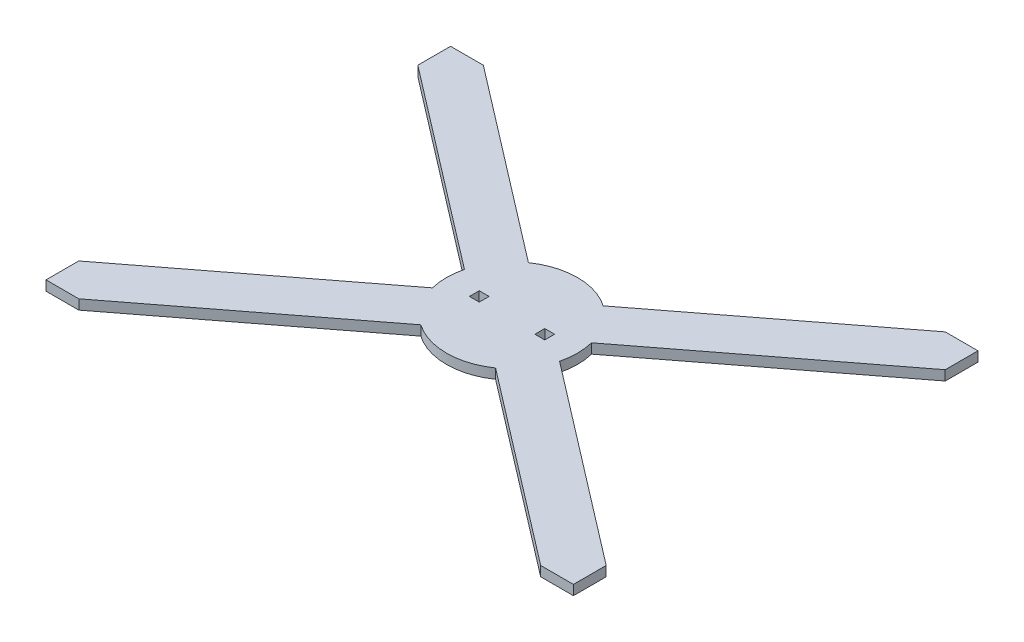
ISO-10303-21;
HEADER;
FILE_DESCRIPTION(('STEP AP214'),'2;1');
FILE_NAME('part.step','',(''),(''),'','','');
FILE_SCHEMA(('AUTOMOTIVE_DESIGN { 1 0 10303 214 1 1 1 1 }'));
ENDSEC;
DATA;
#1=APPLICATION_CONTEXT('core data for automotive mechanical design processes');
#2=APPLICATION_PROTOCOL_DEFINITION('international standard','automotive_design',2000,#1);
#3=PRODUCT_CONTEXT('',#1,'mechanical');
#4=PRODUCT('Part','Part','',(#3));
#5=PRODUCT_RELATED_PRODUCT_CATEGORY('part','',(#4));
#6=PRODUCT_DEFINITION_FORMATION('','',#4);
#7=PRODUCT_DEFINITION_CONTEXT('part definition',#1,'design');
#8=PRODUCT_DEFINITION('design','',#6,#7);
#9=PRODUCT_DEFINITION_SHAPE('','',#8);
#10=(LENGTH_UNIT() NAMED_UNIT(*) SI_UNIT(.MILLI.,.METRE.));
#11=(NAMED_UNIT(*) PLANE_ANGLE_UNIT() SI_UNIT($,.RADIAN.));
#12=(NAMED_UNIT(*) SI_UNIT($,.STERADIAN.) SOLID_ANGLE_UNIT());
#13=UNCERTAINTY_MEASURE_WITH_UNIT(LENGTH_MEASURE(1.E-05),#10,'distance_accuracy_value','');
#14=(GEOMETRIC_REPRESENTATION_CONTEXT(3) GLOBAL_UNCERTAINTY_ASSIGNED_CONTEXT((#13)) GLOBAL_UNIT_ASSIGNED_CONTEXT((#10,
#11,#12)) REPRESENTATION_CONTEXT('',''));
#15=CARTESIAN_POINT('',(0.,0.,0.));
#16=DIRECTION('',(0.,0.,1.));
#17=DIRECTION('',(1.,0.,0.));
#18=AXIS2_PLACEMENT_3D('',#15,#16,#17);
#19=CARTESIAN_POINT('',(0.,6.,0.));
#20=DIRECTION('',(0.,-1.,0.));
#21=DIRECTION('',(0.,0.,-1.));
#22=AXIS2_PLACEMENT_3D('',#19,#20,#21);
#23=CYLINDRICAL_SURFACE('',#22,40.);
#24=CARTESIAN_POINT('',(0.,0.,0.));
#25=DIRECTION('',(0.,-1.,0.));
#26=DIRECTION('',(0.,0.,-1.));
#27=AXIS2_PLACEMENT_3D('',#24,#25,#26);
#28=CIRCLE('',#27,40.);
#29=CARTESIAN_POINT('',(38.7918872543186,0.,9.75650978825062));
#30=VERTEX_POINT('',#29);
#31=CARTESIAN_POINT('',(38.7918872543186,0.,-9.75650978825062));
#32=VERTEX_POINT('',#31);
#33=EDGE_CURVE('E231',#30,#32,#28,.F.);
#34=ORIENTED_EDGE('',*,*,#33,.T.);
#35=DIRECTION('',(0.,-1.,0.));
#36=VECTOR('',#35,1.);
#37=CARTESIAN_POINT('',(38.7918872543187,6.,-9.75650978825063));
#38=LINE('',#37,#36);
#39=CARTESIAN_POINT('',(38.7918872543187,6.,-9.75650978825063));
#40=VERTEX_POINT('',#39);
#41=EDGE_CURVE('E317',#40,#32,#38,.T.);
#42=ORIENTED_EDGE('',*,*,#41,.F.);
#43=CARTESIAN_POINT('',(0.,6.,0.));
#44=DIRECTION('',(0.,1.,0.));
#45=DIRECTION('',(0.,0.,-1.));
#46=AXIS2_PLACEMENT_3D('',#43,#44,#45);
#47=CIRCLE('',#46,39.9999999999999);
#48=CARTESIAN_POINT('',(38.7918872543187,6.,9.75650978825064));
#49=VERTEX_POINT('',#48);
#50=EDGE_CURVE('E396',#49,#40,#47,.T.);
#51=ORIENTED_EDGE('',*,*,#50,.F.);
#52=DIRECTION('',(0.,-1.,0.));
#53=VECTOR('',#52,1.);
#54=CARTESIAN_POINT('',(38.7918872543187,6.,9.75650978825064));
#55=LINE('',#54,#53);
#56=EDGE_CURVE('E320',#49,#30,#55,.T.);
#57=ORIENTED_EDGE('',*,*,#56,.T.);
#58=EDGE_LOOP('',(#34,#42,#51,#57));
#59=FACE_BOUND('',#58,.T.);
#60=ADVANCED_FACE('F35',(#59),#23,.T.);
#61=CARTESIAN_POINT('',(-22.8237669623108,0.,32.849287079785));
#62=VERTEX_POINT('',#61);
#63=CARTESIAN_POINT('',(22.8237669623108,0.,32.849287079785));
#64=VERTEX_POINT('',#63);
#65=EDGE_CURVE('E415',#62,#64,#28,.F.);
#66=ORIENTED_EDGE('',*,*,#65,.T.);
#67=DIRECTION('',(0.,-1.,0.));
#68=VECTOR('',#67,1.);
#69=CARTESIAN_POINT('',(22.8237669623108,6.,32.849287079785));
#70=LINE('',#69,#68);
#71=CARTESIAN_POINT('',(22.8237669623108,6.,32.849287079785));
#72=VERTEX_POINT('',#71);
#73=EDGE_CURVE('E279',#72,#64,#70,.T.);
#74=ORIENTED_EDGE('',*,*,#73,.F.);
#75=CARTESIAN_POINT('',(0.,6.,0.));
#76=DIRECTION('',(0.,1.,0.));
#77=DIRECTION('',(0.,0.,-1.));
#78=AXIS2_PLACEMENT_3D('',#75,#76,#77);
#79=CIRCLE('',#78,40.);
#80=CARTESIAN_POINT('',(-22.8237669623108,6.,32.849287079785));
#81=VERTEX_POINT('',#80);
#82=EDGE_CURVE('E387',#81,#72,#79,.T.);
#83=ORIENTED_EDGE('',*,*,#82,.F.);
#84=DIRECTION('',(0.,-1.,0.));
#85=VECTOR('',#84,1.);
#86=CARTESIAN_POINT('',(-22.8237669623108,6.,32.849287079785));
#87=LINE('',#86,#85);
#88=EDGE_CURVE('E282',#81,#62,#87,.T.);
#89=ORIENTED_EDGE('',*,*,#88,.T.);
#90=EDGE_LOOP('',(#66,#74,#83,#89));
#91=FACE_BOUND('',#90,.T.);
#92=ADVANCED_FACE('F496',(#91),#23,.T.);
#93=CARTESIAN_POINT('',(-38.7918872543186,0.,-9.75650978825061));
#94=VERTEX_POINT('',#93);
#95=CARTESIAN_POINT('',(-38.7918872543186,0.,9.75650978825061));
#96=VERTEX_POINT('',#95);
#97=EDGE_CURVE('E233',#94,#96,#28,.F.);
#98=ORIENTED_EDGE('',*,*,#97,.T.);
#99=DIRECTION('',(0.,-1.,0.));
#100=VECTOR('',#99,1.);
#101=CARTESIAN_POINT('',(-38.7918872543186,6.,9.75650978825062));
#102=LINE('',#101,#100);
#103=CARTESIAN_POINT('',(-38.7918872543186,6.,9.75650978825062));
#104=VERTEX_POINT('',#103);
#105=EDGE_CURVE('E294',#104,#96,#102,.T.);
#106=ORIENTED_EDGE('',*,*,#105,.F.);
#107=CARTESIAN_POINT('',(0.,6.,0.));
#108=DIRECTION('',(0.,1.,0.));
#109=DIRECTION('',(0.,0.,1.));
#110=AXIS2_PLACEMENT_3D('',#107,#108,#109);
#111=CIRCLE('',#110,40.0000000000001);
#112=CARTESIAN_POINT('',(-38.7918872543186,6.,-9.75650978825062));
#113=VERTEX_POINT('',#112);
#114=EDGE_CURVE('E377',#113,#104,#111,.T.);
#115=ORIENTED_EDGE('',*,*,#114,.F.);
#116=DIRECTION('',(0.,-1.,0.));
#117=VECTOR('',#116,1.);
#118=CARTESIAN_POINT('',(-38.7918872543186,6.,-9.75650978825062));
#119=LINE('',#118,#117);
#120=EDGE_CURVE('E297',#113,#94,#119,.T.);
#121=ORIENTED_EDGE('',*,*,#120,.T.);
#122=EDGE_LOOP('',(#98,#106,#115,#121));
#123=FACE_BOUND('',#122,.T.);
#124=ADVANCED_FACE('F501',(#123),#23,.T.);
#125=CARTESIAN_POINT('',(22.8237669623108,0.,-32.849287079785));
#126=VERTEX_POINT('',#125);
#127=CARTESIAN_POINT('',(-22.8237669623108,0.,-32.849287079785));
#128=VERTEX_POINT('',#127);
#129=EDGE_CURVE('E219',#126,#128,#28,.F.);
#130=ORIENTED_EDGE('',*,*,#129,.T.);
#131=DIRECTION('',(0.,-1.,0.));
#132=VECTOR('',#131,1.);
#133=CARTESIAN_POINT('',(-22.8237669623108,6.,-32.849287079785));
#134=LINE('',#133,#132);
#135=CARTESIAN_POINT('',(-22.8237669623108,6.,-32.849287079785));
#136=VERTEX_POINT('',#135);
#137=EDGE_CURVE('E223',#136,#128,#134,.T.);
#138=ORIENTED_EDGE('',*,*,#137,.F.);
#139=CARTESIAN_POINT('',(0.,6.,0.));
#140=DIRECTION('',(0.,1.,0.));
#141=DIRECTION('',(0.,0.,-1.));
#142=AXIS2_PLACEMENT_3D('',#139,#140,#141);
#143=CIRCLE('',#142,40.0000000000001);
#144=CARTESIAN_POINT('',(22.8237669623108,6.,-32.849287079785));
#145=VERTEX_POINT('',#144);
#146=EDGE_CURVE('E362',#145,#136,#143,.T.);
#147=ORIENTED_EDGE('',*,*,#146,.F.);
#148=DIRECTION('',(0.,-1.,0.));
#149=VECTOR('',#148,1.);
#150=CARTESIAN_POINT('',(22.8237669623108,6.,-32.849287079785));
#151=LINE('',#150,#149);
#152=EDGE_CURVE('E226',#145,#126,#151,.T.);
#153=ORIENTED_EDGE('',*,*,#152,.T.);
#154=EDGE_LOOP('',(#130,#138,#147,#153));
#155=FACE_BOUND('',#154,.T.);
#156=ADVANCED_FACE('F221',(#155),#23,.T.);
#157=CARTESIAN_POINT('',(23.,6.,3.));
#158=DIRECTION('',(1.,0.,0.));
#159=DIRECTION('',(0.,0.,-1.));
#160=AXIS2_PLACEMENT_3D('',#157,#158,#159);
#161=PLANE('',#160);
#162=DIRECTION('',(0.,0.,-1.));
#163=VECTOR('',#162,1.);
#164=CARTESIAN_POINT('',(23.,0.,3.));
#165=LINE('',#164,#163);
#166=CARTESIAN_POINT('',(23.,0.,3.));
#167=VERTEX_POINT('',#166);
#168=CARTESIAN_POINT('',(23.,0.,-3.));
#169=VERTEX_POINT('',#168);
#170=EDGE_CURVE('E427',#167,#169,#165,.T.);
#171=ORIENTED_EDGE('',*,*,#170,.F.);
#172=DIRECTION('',(0.,-1.,0.));
#173=VECTOR('',#172,1.);
#174=CARTESIAN_POINT('',(23.,6.,3.));
#175=LINE('',#174,#173);
#176=CARTESIAN_POINT('',(23.,6.,3.));
#177=VERTEX_POINT('',#176);
#178=EDGE_CURVE('E399',#177,#167,#175,.T.);
#179=ORIENTED_EDGE('',*,*,#178,.F.);
#180=DIRECTION('',(0.,0.,1.));
#181=VECTOR('',#180,1.);
#182=CARTESIAN_POINT('',(23.,6.,3.));
#183=LINE('',#182,#181);
#184=CARTESIAN_POINT('',(23.,6.,-3.));
#185=VERTEX_POINT('',#184);
#186=EDGE_CURVE('E429',#185,#177,#183,.T.);
#187=ORIENTED_EDGE('',*,*,#186,.F.);
#188=DIRECTION('',(0.,-1.,0.));
#189=VECTOR('',#188,1.);
#190=CARTESIAN_POINT('',(23.,6.,-3.));
#191=LINE('',#190,#189);
#192=EDGE_CURVE('E434',#185,#169,#191,.T.);
#193=ORIENTED_EDGE('',*,*,#192,.T.);
#194=EDGE_LOOP('',(#171,#179,#187,#193));
#195=FACE_BOUND('',#194,.T.);
#196=ADVANCED_FACE('F477',(#195),#161,.F.);
#197=CARTESIAN_POINT('',(23.,6.,-3.));
#198=DIRECTION('',(0.,0.,-1.));
#199=DIRECTION('',(-1.,0.,0.));
#200=AXIS2_PLACEMENT_3D('',#197,#198,#199);
#201=PLANE('',#200);
#202=DIRECTION('',(-1.,0.,0.));
#203=VECTOR('',#202,1.);
#204=CARTESIAN_POINT('',(23.,0.,-3.));
#205=LINE('',#204,#203);
#206=CARTESIAN_POINT('',(17.,0.,-3.));
#207=VERTEX_POINT('',#206);
#208=EDGE_CURVE('E425',#169,#207,#205,.T.);
#209=ORIENTED_EDGE('',*,*,#208,.F.);
#210=ORIENTED_EDGE('',*,*,#192,.F.);
#211=DIRECTION('',(1.,0.,0.));
#212=VECTOR('',#211,1.);
#213=CARTESIAN_POINT('',(23.,6.,-3.));
#214=LINE('',#213,#212);
#215=CARTESIAN_POINT('',(17.,6.,-3.));
#216=VERTEX_POINT('',#215);
#217=EDGE_CURVE('E459',#216,#185,#214,.T.);
#218=ORIENTED_EDGE('',*,*,#217,.F.);
#219=DIRECTION('',(0.,-1.,0.));
#220=VECTOR('',#219,1.);
#221=CARTESIAN_POINT('',(17.,6.,-3.));
#222=LINE('',#221,#220);
#223=EDGE_CURVE('E464',#216,#207,#222,.T.);
#224=ORIENTED_EDGE('',*,*,#223,.T.);
#225=EDGE_LOOP('',(#209,#210,#218,#224));
#226=FACE_BOUND('',#225,.T.);
#227=ADVANCED_FACE('F480',(#226),#201,.F.);
#228=CARTESIAN_POINT('',(17.,6.,3.));
#229=DIRECTION('',(-1.,0.,0.));
#230=DIRECTION('',(0.,0.,1.));
#231=AXIS2_PLACEMENT_3D('',#228,#229,#230);
#232=PLANE('',#231);
#233=DIRECTION('',(0.,0.,1.));
#234=VECTOR('',#233,1.);
#235=CARTESIAN_POINT('',(17.,0.,3.));
#236=LINE('',#235,#234);
#237=CARTESIAN_POINT('',(17.,0.,3.));
#238=VERTEX_POINT('',#237);
#239=EDGE_CURVE('E50',#207,#238,#236,.T.);
#240=ORIENTED_EDGE('',*,*,#239,.F.);
#241=ORIENTED_EDGE('',*,*,#223,.F.);
#242=DIRECTION('',(0.,0.,-1.));
#243=VECTOR('',#242,1.);
#244=CARTESIAN_POINT('',(17.,6.,3.));
#245=LINE('',#244,#243);
#246=CARTESIAN_POINT('',(17.,6.,3.));
#247=VERTEX_POINT('',#246);
#248=EDGE_CURVE('E456',#247,#216,#245,.T.);
#249=ORIENTED_EDGE('',*,*,#248,.F.);
#250=DIRECTION('',(0.,-1.,0.));
#251=VECTOR('',#250,1.);
#252=CARTESIAN_POINT('',(17.,6.,3.));
#253=LINE('',#252,#251);
#254=EDGE_CURVE('E466',#247,#238,#253,.T.);
#255=ORIENTED_EDGE('',*,*,#254,.T.);
#256=EDGE_LOOP('',(#240,#241,#249,#255));
#257=FACE_BOUND('',#256,.T.);
#258=ADVANCED_FACE('F482',(#257),#232,.F.);
#259=CARTESIAN_POINT('',(23.,6.,3.));
#260=DIRECTION('',(0.,0.,1.));
#261=DIRECTION('',(1.,0.,0.));
#262=AXIS2_PLACEMENT_3D('',#259,#260,#261);
#263=PLANE('',#262);
#264=DIRECTION('',(1.,0.,0.));
#265=VECTOR('',#264,1.);
#266=CARTESIAN_POINT('',(23.,0.,3.));
#267=LINE('',#266,#265);
#268=EDGE_CURVE('E422',#238,#167,#267,.T.);
#269=ORIENTED_EDGE('',*,*,#268,.F.);
#270=ORIENTED_EDGE('',*,*,#254,.F.);
#271=DIRECTION('',(-1.,0.,0.));
#272=VECTOR('',#271,1.);
#273=CARTESIAN_POINT('',(23.,6.,3.));
#274=LINE('',#273,#272);
#275=EDGE_CURVE('E453',#177,#247,#274,.T.);
#276=ORIENTED_EDGE('',*,*,#275,.F.);
#277=ORIENTED_EDGE('',*,*,#178,.T.);
#278=EDGE_LOOP('',(#269,#270,#276,#277));
#279=FACE_BOUND('',#278,.T.);
#280=ADVANCED_FACE('F473',(#279),#263,.F.);
#281=CARTESIAN_POINT('',(-17.,6.,3.));
#282=DIRECTION('',(1.,0.,0.));
#283=DIRECTION('',(0.,0.,-1.));
#284=AXIS2_PLACEMENT_3D('',#281,#282,#283);
#285=PLANE('',#284);
#286=DIRECTION('',(0.,0.,-1.));
#287=VECTOR('',#286,1.);
#288=CARTESIAN_POINT('',(-17.,0.,3.));
#289=LINE('',#288,#287);
#290=CARTESIAN_POINT('',(-17.,0.,3.));
#291=VERTEX_POINT('',#290);
#292=CARTESIAN_POINT('',(-17.,0.,-3.));
#293=VERTEX_POINT('',#292);
#294=EDGE_CURVE('E420',#291,#293,#289,.T.);
#295=ORIENTED_EDGE('',*,*,#294,.F.);
#296=DIRECTION('',(0.,-1.,0.));
#297=VECTOR('',#296,1.);
#298=CARTESIAN_POINT('',(-17.,6.,3.));
#299=LINE('',#298,#297);
#300=CARTESIAN_POINT('',(-17.,6.,3.));
#301=VERTEX_POINT('',#300);
#302=EDGE_CURVE('E442',#301,#291,#299,.T.);
#303=ORIENTED_EDGE('',*,*,#302,.F.);
#304=DIRECTION('',(0.,0.,1.));
#305=VECTOR('',#304,1.);
#306=CARTESIAN_POINT('',(-17.,6.,3.));
#307=LINE('',#306,#305);
#308=CARTESIAN_POINT('',(-17.,6.,-3.));
#309=VERTEX_POINT('',#308);
#310=EDGE_CURVE('E430',#309,#301,#307,.T.);
#311=ORIENTED_EDGE('',*,*,#310,.F.);
#312=DIRECTION('',(0.,-1.,0.));
#313=VECTOR('',#312,1.);
#314=CARTESIAN_POINT('',(-17.,6.,-3.));
#315=LINE('',#314,#313);
#316=EDGE_CURVE('E338',#309,#293,#315,.T.);
#317=ORIENTED_EDGE('',*,*,#316,.T.);
#318=EDGE_LOOP('',(#295,#303,#311,#317));
#319=FACE_BOUND('',#318,.T.);
#320=ADVANCED_FACE('F582',(#319),#285,.F.);
#321=CARTESIAN_POINT('',(-23.,6.,-3.));
#322=DIRECTION('',(0.,0.,-1.));
#323=DIRECTION('',(-1.,0.,0.));
#324=AXIS2_PLACEMENT_3D('',#321,#322,#323);
#325=PLANE('',#324);
#326=DIRECTION('',(-1.,0.,0.));
#327=VECTOR('',#326,1.);
#328=CARTESIAN_POINT('',(-23.,0.,-3.));
#329=LINE('',#328,#327);
#330=CARTESIAN_POINT('',(-23.,0.,-3.));
#331=VERTEX_POINT('',#330);
#332=EDGE_CURVE('E418',#293,#331,#329,.T.);
#333=ORIENTED_EDGE('',*,*,#332,.F.);
#334=ORIENTED_EDGE('',*,*,#316,.F.);
#335=DIRECTION('',(1.,0.,0.));
#336=VECTOR('',#335,1.);
#337=CARTESIAN_POINT('',(-23.,6.,-3.));
#338=LINE('',#337,#336);
#339=CARTESIAN_POINT('',(-23.,6.,-3.));
#340=VERTEX_POINT('',#339);
#341=EDGE_CURVE('E440',#340,#309,#338,.T.);
#342=ORIENTED_EDGE('',*,*,#341,.F.);
#343=DIRECTION('',(0.,-1.,0.));
#344=VECTOR('',#343,1.);
#345=CARTESIAN_POINT('',(-23.,6.,-3.));
#346=LINE('',#345,#344);
#347=EDGE_CURVE('E343',#340,#331,#346,.T.);
#348=ORIENTED_EDGE('',*,*,#347,.T.);
#349=EDGE_LOOP('',(#333,#334,#342,#348));
#350=FACE_BOUND('',#349,.T.);
#351=ADVANCED_FACE('F577',(#350),#325,.F.);
#352=CARTESIAN_POINT('',(-23.,6.,3.));
#353=DIRECTION('',(-1.,0.,0.));
#354=DIRECTION('',(0.,0.,1.));
#355=AXIS2_PLACEMENT_3D('',#352,#353,#354);
#356=PLANE('',#355);
#357=DIRECTION('',(0.,0.,1.));
#358=VECTOR('',#357,1.);
#359=CARTESIAN_POINT('',(-23.,0.,3.));
#360=LINE('',#359,#358);
#361=CARTESIAN_POINT('',(-23.,0.,3.));
#362=VERTEX_POINT('',#361);
#363=EDGE_CURVE('E57',#331,#362,#360,.T.);
#364=ORIENTED_EDGE('',*,*,#363,.F.);
#365=ORIENTED_EDGE('',*,*,#347,.F.);
#366=DIRECTION('',(0.,0.,-1.));
#367=VECTOR('',#366,1.);
#368=CARTESIAN_POINT('',(-23.,6.,3.));
#369=LINE('',#368,#367);
#370=CARTESIAN_POINT('',(-23.,6.,3.));
#371=VERTEX_POINT('',#370);
#372=EDGE_CURVE('E437',#371,#340,#369,.T.);
#373=ORIENTED_EDGE('',*,*,#372,.F.);
#374=DIRECTION('',(0.,-1.,0.));
#375=VECTOR('',#374,1.);
#376=CARTESIAN_POINT('',(-23.,6.,3.));
#377=LINE('',#376,#375);
#378=EDGE_CURVE('E446',#371,#362,#377,.T.);
#379=ORIENTED_EDGE('',*,*,#378,.T.);
#380=EDGE_LOOP('',(#364,#365,#373,#379));
#381=FACE_BOUND('',#380,.T.);
#382=ADVANCED_FACE('F571',(#381),#356,.F.);
#383=CARTESIAN_POINT('',(-23.,6.,3.));
#384=DIRECTION('',(0.,0.,1.));
#385=DIRECTION('',(1.,0.,0.));
#386=AXIS2_PLACEMENT_3D('',#383,#384,#385);
#387=PLANE('',#386);
#388=DIRECTION('',(1.,0.,0.));
#389=VECTOR('',#388,1.);
#390=CARTESIAN_POINT('',(-23.,0.,3.));
#391=LINE('',#390,#389);
#392=EDGE_CURVE('E11',#362,#291,#391,.T.);
#393=ORIENTED_EDGE('',*,*,#392,.F.);
#394=ORIENTED_EDGE('',*,*,#378,.F.);
#395=DIRECTION('',(-1.,0.,0.));
#396=VECTOR('',#395,1.);
#397=CARTESIAN_POINT('',(-23.,6.,3.));
#398=LINE('',#397,#396);
#399=EDGE_CURVE('E433',#301,#371,#398,.T.);
#400=ORIENTED_EDGE('',*,*,#399,.F.);
#401=ORIENTED_EDGE('',*,*,#302,.T.);
#402=EDGE_LOOP('',(#393,#394,#400,#401));
#403=FACE_BOUND('',#402,.T.);
#404=ADVANCED_FACE('F567',(#403),#387,.F.);
#405=CARTESIAN_POINT('',(161.,6.,103.5));
#406=DIRECTION('',(-1.,0.,0.));
#407=DIRECTION('',(0.,0.,1.));
#408=AXIS2_PLACEMENT_3D('',#405,#406,#407);
#409=PLANE('',#408);
#410=DIRECTION('',(0.,0.,-1.));
#411=VECTOR('',#410,1.);
#412=CARTESIAN_POINT('',(161.,0.,103.5));
#413=LINE('',#412,#411);
#414=CARTESIAN_POINT('',(161.,0.,123.5));
#415=VERTEX_POINT('',#414);
#416=CARTESIAN_POINT('',(161.,0.,103.5));
#417=VERTEX_POINT('',#416);
#418=EDGE_CURVE('E335',#415,#417,#413,.T.);
#419=ORIENTED_EDGE('',*,*,#418,.T.);
#420=DIRECTION('',(0.,-1.,0.));
#421=VECTOR('',#420,1.);
#422=CARTESIAN_POINT('',(161.,6.,103.5));
#423=LINE('',#422,#421);
#424=CARTESIAN_POINT('',(161.,6.,103.5));
#425=VERTEX_POINT('',#424);
#426=EDGE_CURVE('E43',#425,#417,#423,.T.);
#427=ORIENTED_EDGE('',*,*,#426,.F.);
#428=DIRECTION('',(0.,0.,-1.));
#429=VECTOR('',#428,1.);
#430=CARTESIAN_POINT('',(161.,6.,103.5));
#431=LINE('',#430,#429);
#432=CARTESIAN_POINT('',(161.,6.,123.5));
#433=VERTEX_POINT('',#432);
#434=EDGE_CURVE('E271',#433,#425,#431,.T.);
#435=ORIENTED_EDGE('',*,*,#434,.F.);
#436=DIRECTION('',(0.,-1.,0.));
#437=VECTOR('',#436,1.);
#438=CARTESIAN_POINT('',(161.,6.,123.5));
#439=LINE('',#438,#437);
#440=EDGE_CURVE('E272',#433,#415,#439,.T.);
#441=ORIENTED_EDGE('',*,*,#440,.T.);
#442=EDGE_LOOP('',(#419,#427,#435,#441));
#443=FACE_BOUND('',#442,.T.);
#444=ADVANCED_FACE('F37',(#443),#409,.F.);
#445=CARTESIAN_POINT('',(38.7918872543187,6.,9.75650978825063));
#446=DIRECTION('',(-0.608638447252298,0.,0.793447692369391));
#447=DIRECTION('',(0.793447692369391,0.,0.608638447252298));
#448=AXIS2_PLACEMENT_3D('',#445,#446,#447);
#449=PLANE('',#448);
#450=DIRECTION('',(-0.793447692369391,0.,-0.608638447252297));
#451=VECTOR('',#450,1.);
#452=CARTESIAN_POINT('',(38.7918872543187,0.,9.75650978825063));
#453=LINE('',#452,#451);
#454=EDGE_CURVE('E329',#417,#30,#453,.T.);
#455=ORIENTED_EDGE('',*,*,#454,.T.);
#456=ORIENTED_EDGE('',*,*,#56,.F.);
#457=DIRECTION('',(-0.793447692369391,0.,-0.608638447252297));
#458=VECTOR('',#457,1.);
#459=CARTESIAN_POINT('',(38.7918872543187,6.,9.75650978825063));
#460=LINE('',#459,#458);
#461=EDGE_CURVE('E330',#425,#49,#460,.T.);
#462=ORIENTED_EDGE('',*,*,#461,.F.);
#463=ORIENTED_EDGE('',*,*,#426,.T.);
#464=EDGE_LOOP('',(#455,#456,#462,#463));
#465=FACE_BOUND('',#464,.T.);
#466=ADVANCED_FACE('F327',(#465),#449,.F.);
#467=CARTESIAN_POINT('',(161.,6.,-103.5));
#468=DIRECTION('',(-0.608638447252298,0.,-0.793447692369391));
#469=DIRECTION('',(-0.793447692369391,0.,0.608638447252298));
#470=AXIS2_PLACEMENT_3D('',#467,#468,#469);
#471=PLANE('',#470);
#472=DIRECTION('',(0.793447692369391,0.,-0.608638447252297));
#473=VECTOR('',#472,1.);
#474=CARTESIAN_POINT('',(161.,0.,-103.5));
#475=LINE('',#474,#473);
#476=CARTESIAN_POINT('',(161.,0.,-103.5));
#477=VERTEX_POINT('',#476);
#478=EDGE_CURVE('E340',#32,#477,#475,.T.);
#479=ORIENTED_EDGE('',*,*,#478,.T.);
#480=DIRECTION('',(0.,-1.,0.));
#481=VECTOR('',#480,1.);
#482=CARTESIAN_POINT('',(161.,6.,-103.5));
#483=LINE('',#482,#481);
#484=CARTESIAN_POINT('',(161.,6.,-103.5));
#485=VERTEX_POINT('',#484);
#486=EDGE_CURVE('E314',#485,#477,#483,.T.);
#487=ORIENTED_EDGE('',*,*,#486,.F.);
#488=DIRECTION('',(0.793447692369391,0.,-0.608638447252297));
#489=VECTOR('',#488,1.);
#490=CARTESIAN_POINT('',(161.,6.,-103.5));
#491=LINE('',#490,#489);
#492=EDGE_CURVE('E403',#40,#485,#491,.T.);
#493=ORIENTED_EDGE('',*,*,#492,.F.);
#494=ORIENTED_EDGE('',*,*,#41,.T.);
#495=EDGE_LOOP('',(#479,#487,#493,#494));
#496=FACE_BOUND('',#495,.T.);
#497=ADVANCED_FACE('F411',(#496),#471,.F.);
#498=CARTESIAN_POINT('',(161.,6.,-103.5));
#499=DIRECTION('',(-1.,0.,0.));
#500=DIRECTION('',(0.,0.,1.));
#501=AXIS2_PLACEMENT_3D('',#498,#499,#500);
#502=PLANE('',#501);
#503=DIRECTION('',(0.,0.,-1.));
#504=VECTOR('',#503,1.);
#505=CARTESIAN_POINT('',(161.,0.,-103.5));
#506=LINE('',#505,#504);
#507=CARTESIAN_POINT('',(161.,0.,-123.5));
#508=VERTEX_POINT('',#507);
#509=EDGE_CURVE('E349',#477,#508,#506,.T.);
#510=ORIENTED_EDGE('',*,*,#509,.T.);
#511=DIRECTION('',(0.,-1.,0.));
#512=VECTOR('',#511,1.);
#513=CARTESIAN_POINT('',(161.,6.,-123.5));
#514=LINE('',#513,#512);
#515=CARTESIAN_POINT('',(161.,6.,-123.5));
#516=VERTEX_POINT('',#515);
#517=EDGE_CURVE('E311',#516,#508,#514,.T.);
#518=ORIENTED_EDGE('',*,*,#517,.F.);
#519=DIRECTION('',(0.,0.,-1.));
#520=VECTOR('',#519,1.);
#521=CARTESIAN_POINT('',(161.,6.,-103.5));
#522=LINE('',#521,#520);
#523=EDGE_CURVE('E366',#485,#516,#522,.T.);
#524=ORIENTED_EDGE('',*,*,#523,.F.);
#525=ORIENTED_EDGE('',*,*,#486,.T.);
#526=EDGE_LOOP('',(#510,#518,#524,#525));
#527=FACE_BOUND('',#526,.T.);
#528=ADVANCED_FACE('F408',(#527),#502,.F.);
#529=CARTESIAN_POINT('',(161.,6.,-123.5));
#530=DIRECTION('',(0.,0.,1.));
#531=DIRECTION('',(1.,0.,0.));
#532=AXIS2_PLACEMENT_3D('',#529,#530,#531);
#533=PLANE('',#532);
#534=DIRECTION('',(-1.,0.,0.));
#535=VECTOR('',#534,1.);
#536=CARTESIAN_POINT('',(161.,0.,-123.5));
#537=LINE('',#536,#535);
#538=CARTESIAN_POINT('',(141.,0.,-123.5));
#539=VERTEX_POINT('',#538);
#540=EDGE_CURVE('E250',#508,#539,#537,.T.);
#541=ORIENTED_EDGE('',*,*,#540,.T.);
#542=DIRECTION('',(0.,-1.,0.));
#543=VECTOR('',#542,1.);
#544=CARTESIAN_POINT('',(141.,6.,-123.5));
#545=LINE('',#544,#543);
#546=CARTESIAN_POINT('',(141.,6.,-123.5));
#547=VERTEX_POINT('',#546);
#548=EDGE_CURVE('E308',#547,#539,#545,.T.);
#549=ORIENTED_EDGE('',*,*,#548,.F.);
#550=DIRECTION('',(-1.,0.,0.));
#551=VECTOR('',#550,1.);
#552=CARTESIAN_POINT('',(161.,6.,-123.5));
#553=LINE('',#552,#551);
#554=EDGE_CURVE('E363',#516,#547,#553,.T.);
#555=ORIENTED_EDGE('',*,*,#554,.F.);
#556=ORIENTED_EDGE('',*,*,#517,.T.);
#557=EDGE_LOOP('',(#541,#549,#555,#556));
#558=FACE_BOUND('',#557,.T.);
#559=ADVANCED_FACE('F353',(#558),#533,.F.);
#560=CARTESIAN_POINT('',(141.,6.,-123.5));
#561=DIRECTION('',(0.608638447252298,0.,0.793447692369391));
#562=DIRECTION('',(0.793447692369391,0.,-0.608638447252298));
#563=AXIS2_PLACEMENT_3D('',#560,#561,#562);
#564=PLANE('',#563);
#565=DIRECTION('',(-0.793447692369391,0.,0.608638447252298));
#566=VECTOR('',#565,1.);
#567=CARTESIAN_POINT('',(141.,0.,-123.5));
#568=LINE('',#567,#566);
#569=EDGE_CURVE('E246',#539,#126,#568,.T.);
#570=ORIENTED_EDGE('',*,*,#569,.T.);
#571=ORIENTED_EDGE('',*,*,#152,.F.);
#572=DIRECTION('',(-0.793447692369391,0.,0.608638447252298));
#573=VECTOR('',#572,1.);
#574=CARTESIAN_POINT('',(141.,6.,-123.5));
#575=LINE('',#574,#573);
#576=EDGE_CURVE('E360',#547,#145,#575,.T.);
#577=ORIENTED_EDGE('',*,*,#576,.F.);
#578=ORIENTED_EDGE('',*,*,#548,.T.);
#579=EDGE_LOOP('',(#570,#571,#577,#578));
#580=FACE_BOUND('',#579,.T.);
#581=ADVANCED_FACE('F359',(#580),#564,.F.);
#582=CARTESIAN_POINT('',(-141.,6.,-123.5));
#583=DIRECTION('',(-0.608638447252298,0.,0.793447692369391));
#584=DIRECTION('',(0.793447692369391,0.,0.608638447252298));
#585=AXIS2_PLACEMENT_3D('',#582,#583,#584);
#586=PLANE('',#585);
#587=DIRECTION('',(-0.793447692369391,0.,-0.608638447252297));
#588=VECTOR('',#587,1.);
#589=CARTESIAN_POINT('',(-141.,0.,-123.5));
#590=LINE('',#589,#588);
#591=CARTESIAN_POINT('',(-141.,0.,-123.5));
#592=VERTEX_POINT('',#591);
#593=EDGE_CURVE('E237',#128,#592,#590,.T.);
#594=ORIENTED_EDGE('',*,*,#593,.T.);
#595=DIRECTION('',(0.,-1.,0.));
#596=VECTOR('',#595,1.);
#597=CARTESIAN_POINT('',(-141.,6.,-123.5));
#598=LINE('',#597,#596);
#599=CARTESIAN_POINT('',(-141.,6.,-123.5));
#600=VERTEX_POINT('',#599);
#601=EDGE_CURVE('E240',#600,#592,#598,.T.);
#602=ORIENTED_EDGE('',*,*,#601,.F.);
#603=DIRECTION('',(-0.793447692369391,0.,-0.608638447252297));
#604=VECTOR('',#603,1.);
#605=CARTESIAN_POINT('',(-141.,6.,-123.5));
#606=LINE('',#605,#604);
#607=EDGE_CURVE('E239',#136,#600,#606,.T.);
#608=ORIENTED_EDGE('',*,*,#607,.F.);
#609=ORIENTED_EDGE('',*,*,#137,.T.);
#610=EDGE_LOOP('',(#594,#602,#608,#609));
#611=FACE_BOUND('',#610,.T.);
#612=ADVANCED_FACE('F235',(#611),#586,.F.);
#613=CARTESIAN_POINT('',(-161.,6.,-123.5));
#614=DIRECTION('',(0.,0.,1.));
#615=DIRECTION('',(1.,0.,0.));
#616=AXIS2_PLACEMENT_3D('',#613,#614,#615);
#617=PLANE('',#616);
#618=DIRECTION('',(-1.,0.,0.));
#619=VECTOR('',#618,1.);
#620=CARTESIAN_POINT('',(-161.,0.,-123.5));
#621=LINE('',#620,#619);
#622=CARTESIAN_POINT('',(-161.,0.,-123.5));
#623=VERTEX_POINT('',#622);
#624=EDGE_CURVE('E245',#592,#623,#621,.T.);
#625=ORIENTED_EDGE('',*,*,#624,.T.);
#626=DIRECTION('',(0.,-1.,0.));
#627=VECTOR('',#626,1.);
#628=CARTESIAN_POINT('',(-161.,6.,-123.5));
#629=LINE('',#628,#627);
#630=CARTESIAN_POINT('',(-161.,6.,-123.5));
#631=VERTEX_POINT('',#630);
#632=EDGE_CURVE('E303',#631,#623,#629,.T.);
#633=ORIENTED_EDGE('',*,*,#632,.F.);
#634=DIRECTION('',(-1.,0.,0.));
#635=VECTOR('',#634,1.);
#636=CARTESIAN_POINT('',(-161.,6.,-123.5));
#637=LINE('',#636,#635);
#638=EDGE_CURVE('E371',#600,#631,#637,.T.);
#639=ORIENTED_EDGE('',*,*,#638,.F.);
#640=ORIENTED_EDGE('',*,*,#601,.T.);
#641=EDGE_LOOP('',(#625,#633,#639,#640));
#642=FACE_BOUND('',#641,.T.);
#643=ADVANCED_FACE('F545',(#642),#617,.F.);
#644=CARTESIAN_POINT('',(-161.,6.,-103.5));
#645=DIRECTION('',(1.,0.,0.));
#646=DIRECTION('',(0.,0.,-1.));
#647=AXIS2_PLACEMENT_3D('',#644,#645,#646);
#648=PLANE('',#647);
#649=DIRECTION('',(0.,0.,1.));
#650=VECTOR('',#649,1.);
#651=CARTESIAN_POINT('',(-161.,0.,-103.5));
#652=LINE('',#651,#650);
#653=CARTESIAN_POINT('',(-161.,0.,-103.5));
#654=VERTEX_POINT('',#653);
#655=EDGE_CURVE('E248',#623,#654,#652,.T.);
#656=ORIENTED_EDGE('',*,*,#655,.T.);
#657=DIRECTION('',(0.,-1.,0.));
#658=VECTOR('',#657,1.);
#659=CARTESIAN_POINT('',(-161.,6.,-103.5));
#660=LINE('',#659,#658);
#661=CARTESIAN_POINT('',(-161.,6.,-103.5));
#662=VERTEX_POINT('',#661);
#663=EDGE_CURVE('E300',#662,#654,#660,.T.);
#664=ORIENTED_EDGE('',*,*,#663,.F.);
#665=DIRECTION('',(0.,0.,1.));
#666=VECTOR('',#665,1.);
#667=CARTESIAN_POINT('',(-161.,6.,-103.5));
#668=LINE('',#667,#666);
#669=EDGE_CURVE('E373',#631,#662,#668,.T.);
#670=ORIENTED_EDGE('',*,*,#669,.F.);
#671=ORIENTED_EDGE('',*,*,#632,.T.);
#672=EDGE_LOOP('',(#656,#664,#670,#671));
#673=FACE_BOUND('',#672,.T.);
#674=ADVANCED_FACE('F541',(#673),#648,.F.);
#675=CARTESIAN_POINT('',(-161.,6.,-103.5));
#676=DIRECTION('',(0.608638447252297,0.,-0.793447692369391));
#677=DIRECTION('',(-0.793447692369392,0.,-0.608638447252297));
#678=AXIS2_PLACEMENT_3D('',#675,#676,#677);
#679=PLANE('',#678);
#680=DIRECTION('',(0.793447692369392,0.,0.608638447252297));
#681=VECTOR('',#680,1.);
#682=CARTESIAN_POINT('',(-161.,0.,-103.5));
#683=LINE('',#682,#681);
#684=EDGE_CURVE('E255',#654,#94,#683,.T.);
#685=ORIENTED_EDGE('',*,*,#684,.T.);
#686=ORIENTED_EDGE('',*,*,#120,.F.);
#687=DIRECTION('',(0.793447692369392,0.,0.608638447252297));
#688=VECTOR('',#687,1.);
#689=CARTESIAN_POINT('',(-161.,6.,-103.5));
#690=LINE('',#689,#688);
#691=EDGE_CURVE('E375',#662,#113,#690,.T.);
#692=ORIENTED_EDGE('',*,*,#691,.F.);
#693=ORIENTED_EDGE('',*,*,#663,.T.);
#694=EDGE_LOOP('',(#685,#686,#692,#693));
#695=FACE_BOUND('',#694,.T.);
#696=ADVANCED_FACE('F539',(#695),#679,.F.);
#697=CARTESIAN_POINT('',(-38.7918872543186,6.,9.75650978825062));
#698=DIRECTION('',(0.608638447252297,0.,0.793447692369391));
#699=DIRECTION('',(0.793447692369392,0.,-0.608638447252297));
#700=AXIS2_PLACEMENT_3D('',#697,#698,#699);
#701=PLANE('',#700);
#702=DIRECTION('',(-0.793447692369392,0.,0.608638447252297));
#703=VECTOR('',#702,1.);
#704=CARTESIAN_POINT('',(-38.7918872543186,0.,9.75650978825062));
#705=LINE('',#704,#703);
#706=CARTESIAN_POINT('',(-161.,0.,103.5));
#707=VERTEX_POINT('',#706);
#708=EDGE_CURVE('E258',#96,#707,#705,.T.);
#709=ORIENTED_EDGE('',*,*,#708,.T.);
#710=DIRECTION('',(0.,-1.,0.));
#711=VECTOR('',#710,1.);
#712=CARTESIAN_POINT('',(-161.,6.,103.5));
#713=LINE('',#712,#711);
#714=CARTESIAN_POINT('',(-161.,6.,103.5));
#715=VERTEX_POINT('',#714);
#716=EDGE_CURVE('E291',#715,#707,#713,.T.);
#717=ORIENTED_EDGE('',*,*,#716,.F.);
#718=DIRECTION('',(-0.793447692369392,0.,0.608638447252297));
#719=VECTOR('',#718,1.);
#720=CARTESIAN_POINT('',(-38.7918872543186,6.,9.75650978825062));
#721=LINE('',#720,#719);
#722=EDGE_CURVE('E379',#104,#715,#721,.T.);
#723=ORIENTED_EDGE('',*,*,#722,.F.);
#724=ORIENTED_EDGE('',*,*,#105,.T.);
#725=EDGE_LOOP('',(#709,#717,#723,#724));
#726=FACE_BOUND('',#725,.T.);
#727=ADVANCED_FACE('F520',(#726),#701,.F.);
#728=CARTESIAN_POINT('',(-161.,6.,103.5));
#729=DIRECTION('',(1.,0.,0.));
#730=DIRECTION('',(0.,0.,-1.));
#731=AXIS2_PLACEMENT_3D('',#728,#729,#730);
#732=PLANE('',#731);
#733=DIRECTION('',(0.,0.,1.));
#734=VECTOR('',#733,1.);
#735=CARTESIAN_POINT('',(-161.,0.,103.5));
#736=LINE('',#735,#734);
#737=CARTESIAN_POINT('',(-161.,0.,123.5));
#738=VERTEX_POINT('',#737);
#739=EDGE_CURVE('E260',#707,#738,#736,.T.);
#740=ORIENTED_EDGE('',*,*,#739,.T.);
#741=DIRECTION('',(0.,-1.,0.));
#742=VECTOR('',#741,1.);
#743=CARTESIAN_POINT('',(-161.,6.,123.5));
#744=LINE('',#743,#742);
#745=CARTESIAN_POINT('',(-161.,6.,123.5));
#746=VERTEX_POINT('',#745);
#747=EDGE_CURVE('E288',#746,#738,#744,.T.);
#748=ORIENTED_EDGE('',*,*,#747,.F.);
#749=DIRECTION('',(0.,0.,1.));
#750=VECTOR('',#749,1.);
#751=CARTESIAN_POINT('',(-161.,6.,103.5));
#752=LINE('',#751,#750);
#753=EDGE_CURVE('E381',#715,#746,#752,.T.);
#754=ORIENTED_EDGE('',*,*,#753,.F.);
#755=ORIENTED_EDGE('',*,*,#716,.T.);
#756=EDGE_LOOP('',(#740,#748,#754,#755));
#757=FACE_BOUND('',#756,.T.);
#758=ADVANCED_FACE('F527',(#757),#732,.F.);
#759=CARTESIAN_POINT('',(-161.,6.,123.5));
#760=DIRECTION('',(0.,0.,-1.));
#761=DIRECTION('',(-1.,0.,0.));
#762=AXIS2_PLACEMENT_3D('',#759,#760,#761);
#763=PLANE('',#762);
#764=DIRECTION('',(1.,0.,0.));
#765=VECTOR('',#764,1.);
#766=CARTESIAN_POINT('',(-161.,0.,123.5));
#767=LINE('',#766,#765);
#768=CARTESIAN_POINT('',(-141.,0.,123.5));
#769=VERTEX_POINT('',#768);
#770=EDGE_CURVE('E262',#738,#769,#767,.T.);
#771=ORIENTED_EDGE('',*,*,#770,.T.);
#772=DIRECTION('',(0.,-1.,0.));
#773=VECTOR('',#772,1.);
#774=CARTESIAN_POINT('',(-141.,6.,123.5));
#775=LINE('',#774,#773);
#776=CARTESIAN_POINT('',(-141.,6.,123.5));
#777=VERTEX_POINT('',#776);
#778=EDGE_CURVE('E285',#777,#769,#775,.T.);
#779=ORIENTED_EDGE('',*,*,#778,.F.);
#780=DIRECTION('',(1.,0.,0.));
#781=VECTOR('',#780,1.);
#782=CARTESIAN_POINT('',(-161.,6.,123.5));
#783=LINE('',#782,#781);
#784=EDGE_CURVE('E383',#746,#777,#783,.T.);
#785=ORIENTED_EDGE('',*,*,#784,.F.);
#786=ORIENTED_EDGE('',*,*,#747,.T.);
#787=EDGE_LOOP('',(#771,#779,#785,#786));
#788=FACE_BOUND('',#787,.T.);
#789=ADVANCED_FACE('F531',(#788),#763,.F.);
#790=CARTESIAN_POINT('',(-141.,6.,123.5));
#791=DIRECTION('',(-0.608638447252298,0.,-0.793447692369391));
#792=DIRECTION('',(-0.793447692369391,0.,0.608638447252298));
#793=AXIS2_PLACEMENT_3D('',#790,#791,#792);
#794=PLANE('',#793);
#795=DIRECTION('',(0.793447692369391,0.,-0.608638447252297));
#796=VECTOR('',#795,1.);
#797=CARTESIAN_POINT('',(-141.,0.,123.5));
#798=LINE('',#797,#796);
#799=EDGE_CURVE('E264',#769,#62,#798,.T.);
#800=ORIENTED_EDGE('',*,*,#799,.T.);
#801=ORIENTED_EDGE('',*,*,#88,.F.);
#802=DIRECTION('',(0.793447692369391,0.,-0.608638447252297));
#803=VECTOR('',#802,1.);
#804=CARTESIAN_POINT('',(-141.,6.,123.5));
#805=LINE('',#804,#803);
#806=EDGE_CURVE('E385',#777,#81,#805,.T.);
#807=ORIENTED_EDGE('',*,*,#806,.F.);
#808=ORIENTED_EDGE('',*,*,#778,.T.);
#809=EDGE_LOOP('',(#800,#801,#807,#808));
#810=FACE_BOUND('',#809,.T.);
#811=ADVANCED_FACE('F663',(#810),#794,.F.);
#812=CARTESIAN_POINT('',(141.,6.,123.5));
#813=DIRECTION('',(0.608638447252298,0.,-0.793447692369391));
#814=DIRECTION('',(-0.793447692369391,0.,-0.608638447252298));
#815=AXIS2_PLACEMENT_3D('',#812,#813,#814);
#816=PLANE('',#815);
#817=DIRECTION('',(0.793447692369391,0.,0.608638447252298));
#818=VECTOR('',#817,1.);
#819=CARTESIAN_POINT('',(141.,0.,123.5));
#820=LINE('',#819,#818);
#821=CARTESIAN_POINT('',(141.,0.,123.5));
#822=VERTEX_POINT('',#821);
#823=EDGE_CURVE('E267',#64,#822,#820,.T.);
#824=ORIENTED_EDGE('',*,*,#823,.T.);
#825=DIRECTION('',(0.,-1.,0.));
#826=VECTOR('',#825,1.);
#827=CARTESIAN_POINT('',(141.,6.,123.5));
#828=LINE('',#827,#826);
#829=CARTESIAN_POINT('',(141.,6.,123.5));
#830=VERTEX_POINT('',#829);
#831=EDGE_CURVE('E275',#830,#822,#828,.T.);
#832=ORIENTED_EDGE('',*,*,#831,.F.);
#833=DIRECTION('',(0.793447692369391,0.,0.608638447252298));
#834=VECTOR('',#833,1.);
#835=CARTESIAN_POINT('',(141.,6.,123.5));
#836=LINE('',#835,#834);
#837=EDGE_CURVE('E388',#72,#830,#836,.T.);
#838=ORIENTED_EDGE('',*,*,#837,.F.);
#839=ORIENTED_EDGE('',*,*,#73,.T.);
#840=EDGE_LOOP('',(#824,#832,#838,#839));
#841=FACE_BOUND('',#840,.T.);
#842=ADVANCED_FACE('F492',(#841),#816,.F.);
#843=CARTESIAN_POINT('',(161.,6.,123.5));
#844=DIRECTION('',(0.,0.,-1.));
#845=DIRECTION('',(-1.,0.,0.));
#846=AXIS2_PLACEMENT_3D('',#843,#844,#845);
#847=PLANE('',#846);
#848=DIRECTION('',(1.,0.,0.));
#849=VECTOR('',#848,1.);
#850=CARTESIAN_POINT('',(161.,0.,123.5));
#851=LINE('',#850,#849);
#852=EDGE_CURVE('E269',#822,#415,#851,.T.);
#853=ORIENTED_EDGE('',*,*,#852,.T.);
#854=ORIENTED_EDGE('',*,*,#440,.F.);
#855=DIRECTION('',(1.,0.,0.));
#856=VECTOR('',#855,1.);
#857=CARTESIAN_POINT('',(161.,6.,123.5));
#858=LINE('',#857,#856);
#859=EDGE_CURVE('E276',#830,#433,#858,.T.);
#860=ORIENTED_EDGE('',*,*,#859,.F.);
#861=ORIENTED_EDGE('',*,*,#831,.T.);
#862=EDGE_LOOP('',(#853,#854,#860,#861));
#863=FACE_BOUND('',#862,.T.);
#864=ADVANCED_FACE('F394',(#863),#847,.F.);
#865=CARTESIAN_POINT('',(0.,6.,0.));
#866=DIRECTION('',(0.,-1.,0.));
#867=DIRECTION('',(0.,0.,-1.));
#868=AXIS2_PLACEMENT_3D('',#865,#866,#867);
#869=PLANE('',#868);
#870=ORIENTED_EDGE('',*,*,#341,.T.);
#871=ORIENTED_EDGE('',*,*,#310,.T.);
#872=ORIENTED_EDGE('',*,*,#399,.T.);
#873=ORIENTED_EDGE('',*,*,#372,.T.);
#874=EDGE_LOOP('',(#870,#871,#872,#873));
#875=FACE_BOUND('',#874,.T.);
#876=ORIENTED_EDGE('',*,*,#217,.T.);
#877=ORIENTED_EDGE('',*,*,#186,.T.);
#878=ORIENTED_EDGE('',*,*,#275,.T.);
#879=ORIENTED_EDGE('',*,*,#248,.T.);
#880=EDGE_LOOP('',(#876,#877,#878,#879));
#881=FACE_BOUND('',#880,.T.);
#882=ORIENTED_EDGE('',*,*,#434,.T.);
#883=ORIENTED_EDGE('',*,*,#461,.T.);
#884=ORIENTED_EDGE('',*,*,#50,.T.);
#885=ORIENTED_EDGE('',*,*,#492,.T.);
#886=ORIENTED_EDGE('',*,*,#523,.T.);
#887=ORIENTED_EDGE('',*,*,#554,.T.);
#888=ORIENTED_EDGE('',*,*,#576,.T.);
#889=ORIENTED_EDGE('',*,*,#146,.T.);
#890=ORIENTED_EDGE('',*,*,#607,.T.);
#891=ORIENTED_EDGE('',*,*,#638,.T.);
#892=ORIENTED_EDGE('',*,*,#669,.T.);
#893=ORIENTED_EDGE('',*,*,#691,.T.);
#894=ORIENTED_EDGE('',*,*,#114,.T.);
#895=ORIENTED_EDGE('',*,*,#722,.T.);
#896=ORIENTED_EDGE('',*,*,#753,.T.);
#897=ORIENTED_EDGE('',*,*,#784,.T.);
#898=ORIENTED_EDGE('',*,*,#806,.T.);
#899=ORIENTED_EDGE('',*,*,#82,.T.);
#900=ORIENTED_EDGE('',*,*,#837,.T.);
#901=ORIENTED_EDGE('',*,*,#859,.T.);
#902=EDGE_LOOP('',(#882,#883,#884,#885,#886,#887,#888,#889,#890,#891,#892,#893,#894,#895,#896,
#897,#898,#899,#900,#901));
#903=FACE_BOUND('',#902,.T.);
#904=ADVANCED_FACE('F392',(#875,#881,#903),#869,.F.);
#905=CARTESIAN_POINT('',(0.,0.,0.));
#906=DIRECTION('',(0.,-1.,0.));
#907=DIRECTION('',(0.,0.,-1.));
#908=AXIS2_PLACEMENT_3D('',#905,#906,#907);
#909=PLANE('',#908);
#910=ORIENTED_EDGE('',*,*,#593,.F.);
#911=ORIENTED_EDGE('',*,*,#129,.F.);
#912=ORIENTED_EDGE('',*,*,#569,.F.);
#913=ORIENTED_EDGE('',*,*,#540,.F.);
#914=ORIENTED_EDGE('',*,*,#509,.F.);
#915=ORIENTED_EDGE('',*,*,#478,.F.);
#916=ORIENTED_EDGE('',*,*,#33,.F.);
#917=ORIENTED_EDGE('',*,*,#454,.F.);
#918=ORIENTED_EDGE('',*,*,#418,.F.);
#919=ORIENTED_EDGE('',*,*,#852,.F.);
#920=ORIENTED_EDGE('',*,*,#823,.F.);
#921=ORIENTED_EDGE('',*,*,#65,.F.);
#922=ORIENTED_EDGE('',*,*,#799,.F.);
#923=ORIENTED_EDGE('',*,*,#770,.F.);
#924=ORIENTED_EDGE('',*,*,#739,.F.);
#925=ORIENTED_EDGE('',*,*,#708,.F.);
#926=ORIENTED_EDGE('',*,*,#97,.F.);
#927=ORIENTED_EDGE('',*,*,#684,.F.);
#928=ORIENTED_EDGE('',*,*,#655,.F.);
#929=ORIENTED_EDGE('',*,*,#624,.F.);
#930=EDGE_LOOP('',(#910,#911,#912,#913,#914,#915,#916,#917,#918,#919,#920,#921,#922,#923,#924,
#925,#926,#927,#928,#929));
#931=FACE_BOUND('',#930,.T.);
#932=ORIENTED_EDGE('',*,*,#294,.T.);
#933=ORIENTED_EDGE('',*,*,#332,.T.);
#934=ORIENTED_EDGE('',*,*,#363,.T.);
#935=ORIENTED_EDGE('',*,*,#392,.T.);
#936=EDGE_LOOP('',(#932,#933,#934,#935));
#937=FACE_BOUND('',#936,.T.);
#938=ORIENTED_EDGE('',*,*,#170,.T.);
#939=ORIENTED_EDGE('',*,*,#208,.T.);
#940=ORIENTED_EDGE('',*,*,#239,.T.);
#941=ORIENTED_EDGE('',*,*,#268,.T.);
#942=EDGE_LOOP('',(#938,#939,#940,#941));
#943=FACE_BOUND('',#942,.T.);
#944=ADVANCED_FACE('F243',(#931,#937,#943),#909,.T.);
#945=CLOSED_SHELL('',(#60,#92,#124,#156,#196,#227,#258,#280,#320,#351,#382,#404,#444,#466,#497,
#528,#559,#581,#612,#643,#674,#696,#727,#758,#789,#811,#842,#864,#904,#944));
#946=MANIFOLD_SOLID_BREP('B2',#945);
#947=ADVANCED_BREP_SHAPE_REPRESENTATION('',(#18,#946),#14);
#948=SHAPE_DEFINITION_REPRESENTATION(#9,#947);
ENDSEC;
END-ISO-10303-21;
